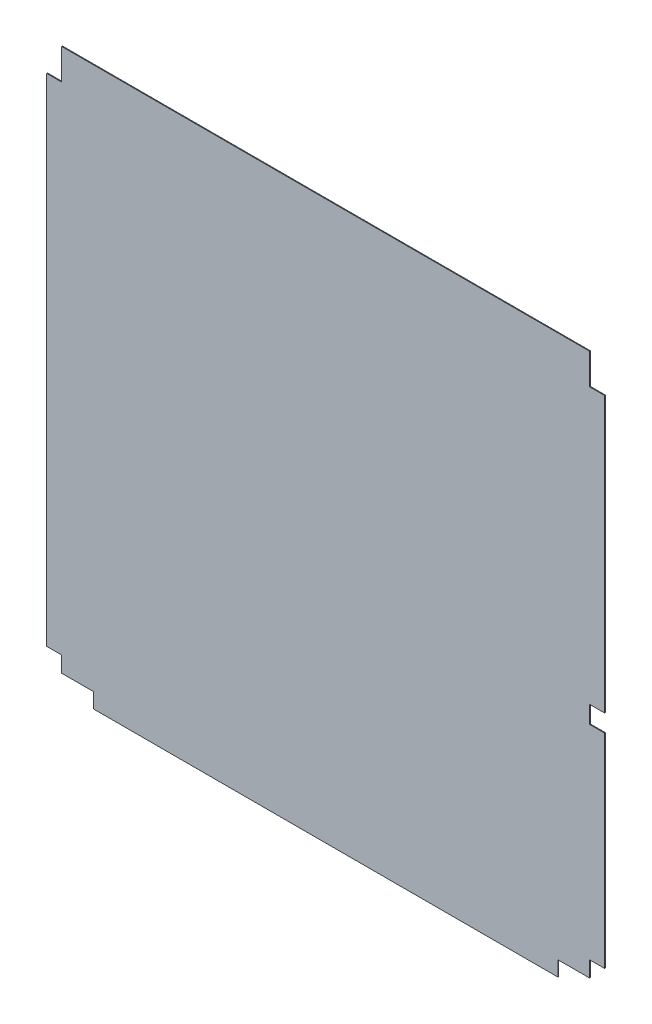
ISO-10303-21;
HEADER;
FILE_DESCRIPTION(('STEP AP214'),'2;1');
FILE_NAME('part.step','',(''),(''),'','','');
FILE_SCHEMA(('AUTOMOTIVE_DESIGN { 1 0 10303 214 1 1 1 1 }'));
ENDSEC;
DATA;
#1=APPLICATION_CONTEXT('core data for automotive mechanical design processes');
#2=APPLICATION_PROTOCOL_DEFINITION('international standard','automotive_design',2000,#1);
#3=PRODUCT_CONTEXT('',#1,'mechanical');
#4=PRODUCT('Part','Part','',(#3));
#5=PRODUCT_RELATED_PRODUCT_CATEGORY('part','',(#4));
#6=PRODUCT_DEFINITION_FORMATION('','',#4);
#7=PRODUCT_DEFINITION_CONTEXT('part definition',#1,'design');
#8=PRODUCT_DEFINITION('design','',#6,#7);
#9=PRODUCT_DEFINITION_SHAPE('','',#8);
#10=(LENGTH_UNIT() NAMED_UNIT(*) SI_UNIT(.MILLI.,.METRE.));
#11=(NAMED_UNIT(*) PLANE_ANGLE_UNIT() SI_UNIT($,.RADIAN.));
#12=(NAMED_UNIT(*) SI_UNIT($,.STERADIAN.) SOLID_ANGLE_UNIT());
#13=UNCERTAINTY_MEASURE_WITH_UNIT(LENGTH_MEASURE(1.E-05),#10,'distance_accuracy_value','');
#14=(GEOMETRIC_REPRESENTATION_CONTEXT(3) GLOBAL_UNCERTAINTY_ASSIGNED_CONTEXT((#13)) GLOBAL_UNIT_ASSIGNED_CONTEXT((#10,
#11,#12)) REPRESENTATION_CONTEXT('',''));
#15=CARTESIAN_POINT('',(0.,0.,0.));
#16=DIRECTION('',(0.,0.,1.));
#17=DIRECTION('',(1.,0.,0.));
#18=AXIS2_PLACEMENT_3D('',#15,#16,#17);
#19=CARTESIAN_POINT('',(0.,279.000000000001,1.));
#20=DIRECTION('',(0.,1.,0.));
#21=DIRECTION('',(0.,0.,1.));
#22=AXIS2_PLACEMENT_3D('',#19,#20,#21);
#23=PLANE('',#22);
#24=DIRECTION('',(1.,0.,0.));
#25=VECTOR('',#24,1.);
#26=CARTESIAN_POINT('',(0.,279.000000000001,0.));
#27=LINE('',#26,#25);
#28=CARTESIAN_POINT('',(-11.0000000000012,279.000000000001,0.));
#29=VERTEX_POINT('',#28);
#30=CARTESIAN_POINT('',(7.9989999999988,279.000000000001,0.));
#31=VERTEX_POINT('',#30);
#32=EDGE_CURVE('E204',#29,#31,#27,.T.);
#33=ORIENTED_EDGE('',*,*,#32,.F.);
#34=DIRECTION('',(0.,0.,-1.));
#35=VECTOR('',#34,1.);
#36=CARTESIAN_POINT('',(-11.0000000000012,279.000000000001,1.));
#37=LINE('',#36,#35);
#38=CARTESIAN_POINT('',(-11.0000000000012,279.000000000001,1.));
#39=VERTEX_POINT('',#38);
#40=EDGE_CURVE('E11',#39,#29,#37,.T.);
#41=ORIENTED_EDGE('',*,*,#40,.F.);
#42=DIRECTION('',(1.,0.,0.));
#43=VECTOR('',#42,1.);
#44=CARTESIAN_POINT('',(0.,279.000000000001,1.));
#45=LINE('',#44,#43);
#46=CARTESIAN_POINT('',(7.9989999999988,279.000000000001,1.));
#47=VERTEX_POINT('',#46);
#48=EDGE_CURVE('E258',#39,#47,#45,.T.);
#49=ORIENTED_EDGE('',*,*,#48,.T.);
#50=DIRECTION('',(0.,0.,-1.));
#51=VECTOR('',#50,1.);
#52=CARTESIAN_POINT('',(7.9989999999988,279.000000000001,1.));
#53=LINE('',#52,#51);
#54=EDGE_CURVE('E125',#47,#31,#53,.T.);
#55=ORIENTED_EDGE('',*,*,#54,.T.);
#56=EDGE_LOOP('',(#33,#41,#49,#55));
#57=FACE_BOUND('',#56,.T.);
#58=ADVANCED_FACE('F39',(#57),#23,.T.);
#59=CARTESIAN_POINT('',(-11.0000000000012,0.,1.));
#60=DIRECTION('',(1.,0.,0.));
#61=DIRECTION('',(0.,0.,-1.));
#62=AXIS2_PLACEMENT_3D('',#59,#60,#61);
#63=PLANE('',#62);
#64=DIRECTION('',(0.,-1.,0.));
#65=VECTOR('',#64,1.);
#66=CARTESIAN_POINT('',(-11.0000000000012,0.,0.));
#67=LINE('',#66,#65);
#68=CARTESIAN_POINT('',(-11.0000000000012,301.000000000001,0.));
#69=VERTEX_POINT('',#68);
#70=EDGE_CURVE('E207',#69,#29,#67,.T.);
#71=ORIENTED_EDGE('',*,*,#70,.F.);
#72=DIRECTION('',(0.,0.,-1.));
#73=VECTOR('',#72,1.);
#74=CARTESIAN_POINT('',(-11.0000000000012,301.000000000001,1.));
#75=LINE('',#74,#73);
#76=CARTESIAN_POINT('',(-11.0000000000012,301.000000000001,1.));
#77=VERTEX_POINT('',#76);
#78=EDGE_CURVE('E47',#77,#69,#75,.T.);
#79=ORIENTED_EDGE('',*,*,#78,.F.);
#80=DIRECTION('',(0.,-1.,0.));
#81=VECTOR('',#80,1.);
#82=CARTESIAN_POINT('',(-11.0000000000012,0.,1.));
#83=LINE('',#82,#81);
#84=EDGE_CURVE('E355',#77,#39,#83,.T.);
#85=ORIENTED_EDGE('',*,*,#84,.T.);
#86=ORIENTED_EDGE('',*,*,#40,.T.);
#87=EDGE_LOOP('',(#71,#79,#85,#86));
#88=FACE_BOUND('',#87,.T.);
#89=ADVANCED_FACE('F301',(#88),#63,.T.);
#90=CARTESIAN_POINT('',(0.,301.000000000001,1.));
#91=DIRECTION('',(0.,-1.,0.));
#92=DIRECTION('',(0.,0.,-1.));
#93=AXIS2_PLACEMENT_3D('',#90,#91,#92);
#94=PLANE('',#93);
#95=DIRECTION('',(-1.,0.,0.));
#96=VECTOR('',#95,1.);
#97=CARTESIAN_POINT('',(0.,301.000000000001,0.));
#98=LINE('',#97,#96);
#99=CARTESIAN_POINT('',(7.9989999999988,301.000000000001,0.));
#100=VERTEX_POINT('',#99);
#101=EDGE_CURVE('E210',#100,#69,#98,.T.);
#102=ORIENTED_EDGE('',*,*,#101,.F.);
#103=DIRECTION('',(0.,0.,-1.));
#104=VECTOR('',#103,1.);
#105=CARTESIAN_POINT('',(7.9989999999988,301.000000000001,1.));
#106=LINE('',#105,#104);
#107=CARTESIAN_POINT('',(7.9989999999988,301.000000000001,1.));
#108=VERTEX_POINT('',#107);
#109=EDGE_CURVE('E290',#108,#100,#106,.T.);
#110=ORIENTED_EDGE('',*,*,#109,.F.);
#111=DIRECTION('',(-1.,0.,0.));
#112=VECTOR('',#111,1.);
#113=CARTESIAN_POINT('',(0.,301.000000000001,1.));
#114=LINE('',#113,#112);
#115=EDGE_CURVE('E297',#108,#77,#114,.T.);
#116=ORIENTED_EDGE('',*,*,#115,.T.);
#117=ORIENTED_EDGE('',*,*,#78,.T.);
#118=EDGE_LOOP('',(#102,#110,#116,#117));
#119=FACE_BOUND('',#118,.T.);
#120=ADVANCED_FACE('F295',(#119),#94,.T.);
#121=CARTESIAN_POINT('',(7.99899999999776,0.,1.));
#122=DIRECTION('',(-1.,0.,0.));
#123=DIRECTION('',(0.,-1.,0.));
#124=AXIS2_PLACEMENT_3D('',#121,#122,#123);
#125=PLANE('',#124);
#126=DIRECTION('',(0.,1.,0.));
#127=VECTOR('',#126,1.);
#128=CARTESIAN_POINT('',(7.99899999999776,0.,0.));
#129=LINE('',#128,#127);
#130=CARTESIAN_POINT('',(7.999,649.,0.));
#131=VERTEX_POINT('',#130);
#132=EDGE_CURVE('E213',#100,#131,#129,.T.);
#133=ORIENTED_EDGE('',*,*,#132,.T.);
#134=DIRECTION('',(0.,0.,-1.));
#135=VECTOR('',#134,1.);
#136=CARTESIAN_POINT('',(7.999,649.,1.));
#137=LINE('',#136,#135);
#138=CARTESIAN_POINT('',(7.999,649.,1.));
#139=VERTEX_POINT('',#138);
#140=EDGE_CURVE('E287',#139,#131,#137,.T.);
#141=ORIENTED_EDGE('',*,*,#140,.F.);
#142=DIRECTION('',(0.,1.,0.));
#143=VECTOR('',#142,1.);
#144=CARTESIAN_POINT('',(7.99899999999776,0.,1.));
#145=LINE('',#144,#143);
#146=EDGE_CURVE('E318',#108,#139,#145,.T.);
#147=ORIENTED_EDGE('',*,*,#146,.F.);
#148=ORIENTED_EDGE('',*,*,#109,.T.);
#149=EDGE_LOOP('',(#133,#141,#147,#148));
#150=FACE_BOUND('',#149,.T.);
#151=ADVANCED_FACE('F309',(#150),#125,.F.);
#152=CARTESIAN_POINT('',(0.,649.,1.));
#153=DIRECTION('',(0.,-1.,0.));
#154=DIRECTION('',(0.,0.,-1.));
#155=AXIS2_PLACEMENT_3D('',#152,#153,#154);
#156=PLANE('',#155);
#157=DIRECTION('',(-1.,0.,0.));
#158=VECTOR('',#157,1.);
#159=CARTESIAN_POINT('',(0.,649.,0.));
#160=LINE('',#159,#158);
#161=CARTESIAN_POINT('',(-11.,649.,0.));
#162=VERTEX_POINT('',#161);
#163=EDGE_CURVE('E215',#131,#162,#160,.T.);
#164=ORIENTED_EDGE('',*,*,#163,.T.);
#165=DIRECTION('',(0.,0.,-1.));
#166=VECTOR('',#165,1.);
#167=CARTESIAN_POINT('',(-11.,649.,1.));
#168=LINE('',#167,#166);
#169=CARTESIAN_POINT('',(-11.,649.,1.));
#170=VERTEX_POINT('',#169);
#171=EDGE_CURVE('E284',#170,#162,#168,.T.);
#172=ORIENTED_EDGE('',*,*,#171,.F.);
#173=DIRECTION('',(-1.,0.,0.));
#174=VECTOR('',#173,1.);
#175=CARTESIAN_POINT('',(0.,649.,1.));
#176=LINE('',#175,#174);
#177=EDGE_CURVE('E315',#139,#170,#176,.T.);
#178=ORIENTED_EDGE('',*,*,#177,.F.);
#179=ORIENTED_EDGE('',*,*,#140,.T.);
#180=EDGE_LOOP('',(#164,#172,#178,#179));
#181=FACE_BOUND('',#180,.T.);
#182=ADVANCED_FACE('F313',(#181),#156,.F.);
#183=CARTESIAN_POINT('',(-11.,0.,1.));
#184=DIRECTION('',(-1.,0.,0.));
#185=DIRECTION('',(0.,0.,1.));
#186=AXIS2_PLACEMENT_3D('',#183,#184,#185);
#187=PLANE('',#186);
#188=DIRECTION('',(0.,1.,0.));
#189=VECTOR('',#188,1.);
#190=CARTESIAN_POINT('',(-11.,0.,0.));
#191=LINE('',#190,#189);
#192=CARTESIAN_POINT('',(-11.,687.999,0.));
#193=VERTEX_POINT('',#192);
#194=EDGE_CURVE('E217',#162,#193,#191,.T.);
#195=ORIENTED_EDGE('',*,*,#194,.T.);
#196=DIRECTION('',(0.,0.,-1.));
#197=VECTOR('',#196,1.);
#198=CARTESIAN_POINT('',(-11.,687.999,1.));
#199=LINE('',#198,#197);
#200=CARTESIAN_POINT('',(-11.,687.999,1.));
#201=VERTEX_POINT('',#200);
#202=EDGE_CURVE('E282',#201,#193,#199,.T.);
#203=ORIENTED_EDGE('',*,*,#202,.F.);
#204=DIRECTION('',(0.,1.,0.));
#205=VECTOR('',#204,1.);
#206=CARTESIAN_POINT('',(-11.,0.,1.));
#207=LINE('',#206,#205);
#208=EDGE_CURVE('E317',#170,#201,#207,.T.);
#209=ORIENTED_EDGE('',*,*,#208,.F.);
#210=ORIENTED_EDGE('',*,*,#171,.T.);
#211=EDGE_LOOP('',(#195,#203,#209,#210));
#212=FACE_BOUND('',#211,.T.);
#213=ADVANCED_FACE('F371',(#212),#187,.F.);
#214=CARTESIAN_POINT('',(1.37010284803689E-12,687.999,1.));
#215=DIRECTION('',(0.,1.,0.));
#216=DIRECTION('',(-1.,0.,0.));
#217=AXIS2_PLACEMENT_3D('',#214,#215,#216);
#218=PLANE('',#217);
#219=DIRECTION('',(1.,0.,0.));
#220=VECTOR('',#219,1.);
#221=CARTESIAN_POINT('',(1.37010284803689E-12,687.999,0.));
#222=LINE('',#221,#220);
#223=CARTESIAN_POINT('',(-678.999993815225,687.999000000001,0.));
#224=VERTEX_POINT('',#223);
#225=EDGE_CURVE('E220',#224,#193,#222,.T.);
#226=ORIENTED_EDGE('',*,*,#225,.F.);
#227=DIRECTION('',(0.,0.,-1.));
#228=VECTOR('',#227,1.);
#229=CARTESIAN_POINT('',(-678.999993815225,687.999000000001,1.));
#230=LINE('',#229,#228);
#231=CARTESIAN_POINT('',(-678.999993815225,687.999000000001,1.));
#232=VERTEX_POINT('',#231);
#233=EDGE_CURVE('E280',#232,#224,#230,.T.);
#234=ORIENTED_EDGE('',*,*,#233,.F.);
#235=DIRECTION('',(1.,0.,0.));
#236=VECTOR('',#235,1.);
#237=CARTESIAN_POINT('',(1.37010284803689E-12,687.999,1.));
#238=LINE('',#237,#236);
#239=EDGE_CURVE('E320',#232,#201,#238,.T.);
#240=ORIENTED_EDGE('',*,*,#239,.T.);
#241=ORIENTED_EDGE('',*,*,#202,.T.);
#242=EDGE_LOOP('',(#226,#234,#240,#241));
#243=FACE_BOUND('',#242,.T.);
#244=ADVANCED_FACE('F374',(#243),#218,.T.);
#245=CARTESIAN_POINT('',(-678.999993815225,0.,1.));
#246=DIRECTION('',(1.,0.,0.));
#247=DIRECTION('',(0.,0.,-1.));
#248=AXIS2_PLACEMENT_3D('',#245,#246,#247);
#249=PLANE('',#248);
#250=DIRECTION('',(0.,-1.,0.));
#251=VECTOR('',#250,1.);
#252=CARTESIAN_POINT('',(-678.999993815225,0.,0.));
#253=LINE('',#252,#251);
#254=CARTESIAN_POINT('',(-678.999993815225,649.000000000001,0.));
#255=VERTEX_POINT('',#254);
#256=EDGE_CURVE('E223',#224,#255,#253,.T.);
#257=ORIENTED_EDGE('',*,*,#256,.T.);
#258=DIRECTION('',(0.,0.,-1.));
#259=VECTOR('',#258,1.);
#260=CARTESIAN_POINT('',(-678.999993815225,649.000000000001,1.));
#261=LINE('',#260,#259);
#262=CARTESIAN_POINT('',(-678.999993815225,649.000000000001,1.));
#263=VERTEX_POINT('',#262);
#264=EDGE_CURVE('E278',#263,#255,#261,.T.);
#265=ORIENTED_EDGE('',*,*,#264,.F.);
#266=DIRECTION('',(0.,-1.,0.));
#267=VECTOR('',#266,1.);
#268=CARTESIAN_POINT('',(-678.999993815225,0.,1.));
#269=LINE('',#268,#267);
#270=EDGE_CURVE('E327',#232,#263,#269,.T.);
#271=ORIENTED_EDGE('',*,*,#270,.F.);
#272=ORIENTED_EDGE('',*,*,#233,.T.);
#273=EDGE_LOOP('',(#257,#265,#271,#272));
#274=FACE_BOUND('',#273,.T.);
#275=ADVANCED_FACE('F378',(#274),#249,.F.);
#276=CARTESIAN_POINT('',(3.79248649099919E-12,648.999999999997,1.));
#277=DIRECTION('',(0.,1.,0.));
#278=DIRECTION('',(-1.,0.,0.));
#279=AXIS2_PLACEMENT_3D('',#276,#277,#278);
#280=PLANE('',#279);
#281=DIRECTION('',(1.,0.,0.));
#282=VECTOR('',#281,1.);
#283=CARTESIAN_POINT('',(3.79248649099919E-12,648.999999999997,0.));
#284=LINE('',#283,#282);
#285=CARTESIAN_POINT('',(-697.999000000001,649.000000000001,0.));
#286=VERTEX_POINT('',#285);
#287=EDGE_CURVE('E226',#286,#255,#284,.T.);
#288=ORIENTED_EDGE('',*,*,#287,.F.);
#289=DIRECTION('',(0.,0.,-1.));
#290=VECTOR('',#289,1.);
#291=CARTESIAN_POINT('',(-697.999000000001,649.000000000001,1.));
#292=LINE('',#291,#290);
#293=CARTESIAN_POINT('',(-697.999000000001,649.000000000001,1.));
#294=VERTEX_POINT('',#293);
#295=EDGE_CURVE('E276',#294,#286,#292,.T.);
#296=ORIENTED_EDGE('',*,*,#295,.F.);
#297=DIRECTION('',(1.,0.,0.));
#298=VECTOR('',#297,1.);
#299=CARTESIAN_POINT('',(3.79248649099919E-12,648.999999999997,1.));
#300=LINE('',#299,#298);
#301=EDGE_CURVE('E329',#294,#263,#300,.T.);
#302=ORIENTED_EDGE('',*,*,#301,.T.);
#303=ORIENTED_EDGE('',*,*,#264,.T.);
#304=EDGE_LOOP('',(#288,#296,#302,#303));
#305=FACE_BOUND('',#304,.T.);
#306=ADVANCED_FACE('F382',(#305),#280,.T.);
#307=CARTESIAN_POINT('',(-697.999,-1.35736945392017E-12,1.));
#308=DIRECTION('',(-1.,0.,0.));
#309=DIRECTION('',(0.,-1.,0.));
#310=AXIS2_PLACEMENT_3D('',#307,#308,#309);
#311=PLANE('',#310);
#312=DIRECTION('',(0.,1.,0.));
#313=VECTOR('',#312,1.);
#314=CARTESIAN_POINT('',(-697.999,-1.35736945392017E-12,0.));
#315=LINE('',#314,#313);
#316=CARTESIAN_POINT('',(-697.999,21.,0.));
#317=VERTEX_POINT('',#316);
#318=EDGE_CURVE('E229',#317,#286,#315,.T.);
#319=ORIENTED_EDGE('',*,*,#318,.F.);
#320=DIRECTION('',(0.,0.,-1.));
#321=VECTOR('',#320,1.);
#322=CARTESIAN_POINT('',(-697.999,21.,1.));
#323=LINE('',#322,#321);
#324=CARTESIAN_POINT('',(-697.999,21.,1.));
#325=VERTEX_POINT('',#324);
#326=EDGE_CURVE('E274',#325,#317,#323,.T.);
#327=ORIENTED_EDGE('',*,*,#326,.F.);
#328=DIRECTION('',(0.,1.,0.));
#329=VECTOR('',#328,1.);
#330=CARTESIAN_POINT('',(-697.999,-1.35736945392017E-12,1.));
#331=LINE('',#330,#329);
#332=EDGE_CURVE('E332',#325,#294,#331,.T.);
#333=ORIENTED_EDGE('',*,*,#332,.T.);
#334=ORIENTED_EDGE('',*,*,#295,.T.);
#335=EDGE_LOOP('',(#319,#327,#333,#334));
#336=FACE_BOUND('',#335,.T.);
#337=ADVANCED_FACE('F386',(#336),#311,.T.);
#338=CARTESIAN_POINT('',(0.,21.,1.));
#339=DIRECTION('',(0.,1.,0.));
#340=DIRECTION('',(0.,0.,1.));
#341=AXIS2_PLACEMENT_3D('',#338,#339,#340);
#342=PLANE('',#341);
#343=DIRECTION('',(1.,0.,0.));
#344=VECTOR('',#343,1.);
#345=CARTESIAN_POINT('',(0.,21.,0.));
#346=LINE('',#345,#344);
#347=CARTESIAN_POINT('',(-679.000000000001,21.,0.));
#348=VERTEX_POINT('',#347);
#349=EDGE_CURVE('E232',#317,#348,#346,.T.);
#350=ORIENTED_EDGE('',*,*,#349,.T.);
#351=DIRECTION('',(0.,0.,-1.));
#352=VECTOR('',#351,1.);
#353=CARTESIAN_POINT('',(-679.000000000001,21.,1.));
#354=LINE('',#353,#352);
#355=CARTESIAN_POINT('',(-679.000000000001,21.,1.));
#356=VERTEX_POINT('',#355);
#357=EDGE_CURVE('E272',#356,#348,#354,.T.);
#358=ORIENTED_EDGE('',*,*,#357,.F.);
#359=DIRECTION('',(1.,0.,0.));
#360=VECTOR('',#359,1.);
#361=CARTESIAN_POINT('',(0.,21.,1.));
#362=LINE('',#361,#360);
#363=EDGE_CURVE('E335',#325,#356,#362,.T.);
#364=ORIENTED_EDGE('',*,*,#363,.F.);
#365=ORIENTED_EDGE('',*,*,#326,.T.);
#366=EDGE_LOOP('',(#350,#358,#364,#365));
#367=FACE_BOUND('',#366,.T.);
#368=ADVANCED_FACE('F390',(#367),#342,.F.);
#369=CARTESIAN_POINT('',(-679.000000000001,0.,1.));
#370=DIRECTION('',(-1.,0.,0.));
#371=DIRECTION('',(0.,0.,1.));
#372=AXIS2_PLACEMENT_3D('',#369,#370,#371);
#373=PLANE('',#372);
#374=DIRECTION('',(0.,1.,0.));
#375=VECTOR('',#374,1.);
#376=CARTESIAN_POINT('',(-679.000000000001,0.,0.));
#377=LINE('',#376,#375);
#378=CARTESIAN_POINT('',(-679.000000000001,1.00000000000141,0.));
#379=VERTEX_POINT('',#378);
#380=EDGE_CURVE('E235',#379,#348,#377,.T.);
#381=ORIENTED_EDGE('',*,*,#380,.F.);
#382=DIRECTION('',(0.,0.,-1.));
#383=VECTOR('',#382,1.);
#384=CARTESIAN_POINT('',(-679.000000000001,1.00000000000141,1.));
#385=LINE('',#384,#383);
#386=CARTESIAN_POINT('',(-679.000000000001,1.00000000000141,1.));
#387=VERTEX_POINT('',#386);
#388=EDGE_CURVE('E270',#387,#379,#385,.T.);
#389=ORIENTED_EDGE('',*,*,#388,.F.);
#390=DIRECTION('',(0.,1.,0.));
#391=VECTOR('',#390,1.);
#392=CARTESIAN_POINT('',(-679.000000000001,0.,1.));
#393=LINE('',#392,#391);
#394=EDGE_CURVE('E337',#387,#356,#393,.T.);
#395=ORIENTED_EDGE('',*,*,#394,.T.);
#396=ORIENTED_EDGE('',*,*,#357,.T.);
#397=EDGE_LOOP('',(#381,#389,#395,#396));
#398=FACE_BOUND('',#397,.T.);
#399=ADVANCED_FACE('F394',(#398),#373,.T.);
#400=CARTESIAN_POINT('',(0.,0.999999999977404,1.));
#401=DIRECTION('',(0.,-1.,0.));
#402=DIRECTION('',(1.,0.,0.));
#403=AXIS2_PLACEMENT_3D('',#400,#401,#402);
#404=PLANE('',#403);
#405=DIRECTION('',(-1.,0.,0.));
#406=VECTOR('',#405,1.);
#407=CARTESIAN_POINT('',(0.,0.999999999977404,0.));
#408=LINE('',#407,#406);
#409=CARTESIAN_POINT('',(-638.999993815225,1.,0.));
#410=VERTEX_POINT('',#409);
#411=EDGE_CURVE('E238',#410,#379,#408,.T.);
#412=ORIENTED_EDGE('',*,*,#411,.F.);
#413=DIRECTION('',(0.,0.,-1.));
#414=VECTOR('',#413,1.);
#415=CARTESIAN_POINT('',(-638.999993815225,1.,1.));
#416=LINE('',#415,#414);
#417=CARTESIAN_POINT('',(-638.999993815225,1.,1.));
#418=VERTEX_POINT('',#417);
#419=EDGE_CURVE('E268',#418,#410,#416,.T.);
#420=ORIENTED_EDGE('',*,*,#419,.F.);
#421=DIRECTION('',(-1.,0.,0.));
#422=VECTOR('',#421,1.);
#423=CARTESIAN_POINT('',(0.,0.999999999977404,1.));
#424=LINE('',#423,#422);
#425=EDGE_CURVE('E340',#418,#387,#424,.T.);
#426=ORIENTED_EDGE('',*,*,#425,.T.);
#427=ORIENTED_EDGE('',*,*,#388,.T.);
#428=EDGE_LOOP('',(#412,#420,#426,#427));
#429=FACE_BOUND('',#428,.T.);
#430=ADVANCED_FACE('F398',(#429),#404,.T.);
#431=CARTESIAN_POINT('',(-638.999993815225,0.,1.));
#432=DIRECTION('',(-1.,0.,0.));
#433=DIRECTION('',(0.,0.,1.));
#434=AXIS2_PLACEMENT_3D('',#431,#432,#433);
#435=PLANE('',#434);
#436=DIRECTION('',(0.,1.,0.));
#437=VECTOR('',#436,1.);
#438=CARTESIAN_POINT('',(-638.999993815225,0.,0.));
#439=LINE('',#438,#437);
#440=CARTESIAN_POINT('',(-638.999993815225,-17.9989999999986,0.));
#441=VERTEX_POINT('',#440);
#442=EDGE_CURVE('E241',#441,#410,#439,.T.);
#443=ORIENTED_EDGE('',*,*,#442,.F.);
#444=DIRECTION('',(0.,0.,-1.));
#445=VECTOR('',#444,1.);
#446=CARTESIAN_POINT('',(-638.999993815225,-17.9989999999986,1.));
#447=LINE('',#446,#445);
#448=CARTESIAN_POINT('',(-638.999993815225,-17.9989999999986,1.));
#449=VERTEX_POINT('',#448);
#450=EDGE_CURVE('E266',#449,#441,#447,.T.);
#451=ORIENTED_EDGE('',*,*,#450,.F.);
#452=DIRECTION('',(0.,1.,0.));
#453=VECTOR('',#452,1.);
#454=CARTESIAN_POINT('',(-638.999993815225,0.,1.));
#455=LINE('',#454,#453);
#456=EDGE_CURVE('E343',#449,#418,#455,.T.);
#457=ORIENTED_EDGE('',*,*,#456,.T.);
#458=ORIENTED_EDGE('',*,*,#419,.T.);
#459=EDGE_LOOP('',(#443,#451,#457,#458));
#460=FACE_BOUND('',#459,.T.);
#461=ADVANCED_FACE('F402',(#460),#435,.T.);
#462=CARTESIAN_POINT('',(0.,-17.9989999999984,1.));
#463=DIRECTION('',(0.,1.,0.));
#464=DIRECTION('',(-1.,0.,0.));
#465=AXIS2_PLACEMENT_3D('',#462,#463,#464);
#466=PLANE('',#465);
#467=DIRECTION('',(1.,0.,0.));
#468=VECTOR('',#467,1.);
#469=CARTESIAN_POINT('',(0.,-17.9989999999984,0.));
#470=LINE('',#469,#468);
#471=CARTESIAN_POINT('',(-50.9999968921069,-17.9989999999984,0.));
#472=VERTEX_POINT('',#471);
#473=EDGE_CURVE('E244',#441,#472,#470,.T.);
#474=ORIENTED_EDGE('',*,*,#473,.T.);
#475=DIRECTION('',(0.,0.,-1.));
#476=VECTOR('',#475,1.);
#477=CARTESIAN_POINT('',(-50.9999968921069,-17.9989999999984,1.));
#478=LINE('',#477,#476);
#479=CARTESIAN_POINT('',(-50.9999968921069,-17.9989999999984,1.));
#480=VERTEX_POINT('',#479);
#481=EDGE_CURVE('E264',#480,#472,#478,.T.);
#482=ORIENTED_EDGE('',*,*,#481,.F.);
#483=DIRECTION('',(1.,0.,0.));
#484=VECTOR('',#483,1.);
#485=CARTESIAN_POINT('',(0.,-17.9989999999984,1.));
#486=LINE('',#485,#484);
#487=EDGE_CURVE('E346',#449,#480,#486,.T.);
#488=ORIENTED_EDGE('',*,*,#487,.F.);
#489=ORIENTED_EDGE('',*,*,#450,.T.);
#490=EDGE_LOOP('',(#474,#482,#488,#489));
#491=FACE_BOUND('',#490,.T.);
#492=ADVANCED_FACE('F406',(#491),#466,.F.);
#493=CARTESIAN_POINT('',(-50.9999968921069,0.,1.));
#494=DIRECTION('',(1.,0.,0.));
#495=DIRECTION('',(0.,0.,-1.));
#496=AXIS2_PLACEMENT_3D('',#493,#494,#495);
#497=PLANE('',#496);
#498=DIRECTION('',(0.,-1.,0.));
#499=VECTOR('',#498,1.);
#500=CARTESIAN_POINT('',(-50.9999968921069,0.,0.));
#501=LINE('',#500,#499);
#502=CARTESIAN_POINT('',(-50.9999968921069,1.,0.));
#503=VERTEX_POINT('',#502);
#504=EDGE_CURVE('E247',#503,#472,#501,.T.);
#505=ORIENTED_EDGE('',*,*,#504,.F.);
#506=DIRECTION('',(0.,0.,-1.));
#507=VECTOR('',#506,1.);
#508=CARTESIAN_POINT('',(-50.9999968921069,1.,1.));
#509=LINE('',#508,#507);
#510=CARTESIAN_POINT('',(-50.9999968921069,1.,1.));
#511=VERTEX_POINT('',#510);
#512=EDGE_CURVE('E262',#511,#503,#509,.T.);
#513=ORIENTED_EDGE('',*,*,#512,.F.);
#514=DIRECTION('',(0.,-1.,0.));
#515=VECTOR('',#514,1.);
#516=CARTESIAN_POINT('',(-50.9999968921069,0.,1.));
#517=LINE('',#516,#515);
#518=EDGE_CURVE('E348',#511,#480,#517,.T.);
#519=ORIENTED_EDGE('',*,*,#518,.T.);
#520=ORIENTED_EDGE('',*,*,#481,.T.);
#521=EDGE_LOOP('',(#505,#513,#519,#520));
#522=FACE_BOUND('',#521,.T.);
#523=ADVANCED_FACE('F410',(#522),#497,.T.);
#524=CARTESIAN_POINT('',(0.,1.,1.));
#525=DIRECTION('',(0.,-1.,0.));
#526=DIRECTION('',(0.,0.,-1.));
#527=AXIS2_PLACEMENT_3D('',#524,#525,#526);
#528=PLANE('',#527);
#529=DIRECTION('',(-1.,0.,0.));
#530=VECTOR('',#529,1.);
#531=CARTESIAN_POINT('',(0.,1.,0.));
#532=LINE('',#531,#530);
#533=CARTESIAN_POINT('',(-11.0000000000001,1.,0.));
#534=VERTEX_POINT('',#533);
#535=EDGE_CURVE('E250',#534,#503,#532,.T.);
#536=ORIENTED_EDGE('',*,*,#535,.F.);
#537=DIRECTION('',(0.,0.,-1.));
#538=VECTOR('',#537,1.);
#539=CARTESIAN_POINT('',(-11.0000000000001,1.,1.));
#540=LINE('',#539,#538);
#541=CARTESIAN_POINT('',(-11.0000000000001,1.,1.));
#542=VERTEX_POINT('',#541);
#543=EDGE_CURVE('E197',#542,#534,#540,.T.);
#544=ORIENTED_EDGE('',*,*,#543,.F.);
#545=DIRECTION('',(-1.,0.,0.));
#546=VECTOR('',#545,1.);
#547=CARTESIAN_POINT('',(0.,1.,1.));
#548=LINE('',#547,#546);
#549=EDGE_CURVE('E186',#542,#511,#548,.T.);
#550=ORIENTED_EDGE('',*,*,#549,.T.);
#551=ORIENTED_EDGE('',*,*,#512,.T.);
#552=EDGE_LOOP('',(#536,#544,#550,#551));
#553=FACE_BOUND('',#552,.T.);
#554=ADVANCED_FACE('F352',(#553),#528,.T.);
#555=CARTESIAN_POINT('',(-11.0000000000001,0.,1.));
#556=DIRECTION('',(-1.,0.,0.));
#557=DIRECTION('',(0.,0.,1.));
#558=AXIS2_PLACEMENT_3D('',#555,#556,#557);
#559=PLANE('',#558);
#560=DIRECTION('',(0.,1.,0.));
#561=VECTOR('',#560,1.);
#562=CARTESIAN_POINT('',(-11.0000000000001,0.,0.));
#563=LINE('',#562,#561);
#564=CARTESIAN_POINT('',(-11.0000000000001,21.,0.));
#565=VERTEX_POINT('',#564);
#566=EDGE_CURVE('E193',#534,#565,#563,.T.);
#567=ORIENTED_EDGE('',*,*,#566,.T.);
#568=DIRECTION('',(0.,0.,-1.));
#569=VECTOR('',#568,1.);
#570=CARTESIAN_POINT('',(-11.0000000000001,21.,1.));
#571=LINE('',#570,#569);
#572=CARTESIAN_POINT('',(-11.0000000000001,21.,1.));
#573=VERTEX_POINT('',#572);
#574=EDGE_CURVE('E190',#573,#565,#571,.T.);
#575=ORIENTED_EDGE('',*,*,#574,.F.);
#576=DIRECTION('',(0.,1.,0.));
#577=VECTOR('',#576,1.);
#578=CARTESIAN_POINT('',(-11.0000000000001,0.,1.));
#579=LINE('',#578,#577);
#580=EDGE_CURVE('E179',#542,#573,#579,.T.);
#581=ORIENTED_EDGE('',*,*,#580,.F.);
#582=ORIENTED_EDGE('',*,*,#543,.T.);
#583=EDGE_LOOP('',(#567,#575,#581,#582));
#584=FACE_BOUND('',#583,.T.);
#585=ADVANCED_FACE('F191',(#584),#559,.F.);
#586=CARTESIAN_POINT('',(0.,21.,1.));
#587=DIRECTION('',(0.,-1.,0.));
#588=DIRECTION('',(0.,0.,-1.));
#589=AXIS2_PLACEMENT_3D('',#586,#587,#588);
#590=PLANE('',#589);
#591=DIRECTION('',(-1.,0.,0.));
#592=VECTOR('',#591,1.);
#593=CARTESIAN_POINT('',(0.,21.,0.));
#594=LINE('',#593,#592);
#595=CARTESIAN_POINT('',(7.999,21.,0.));
#596=VERTEX_POINT('',#595);
#597=EDGE_CURVE('E254',#596,#565,#594,.T.);
#598=ORIENTED_EDGE('',*,*,#597,.F.);
#599=DIRECTION('',(0.,0.,-1.));
#600=VECTOR('',#599,1.);
#601=CARTESIAN_POINT('',(7.999,21.,1.));
#602=LINE('',#601,#600);
#603=CARTESIAN_POINT('',(7.999,21.,1.));
#604=VERTEX_POINT('',#603);
#605=EDGE_CURVE('E118',#604,#596,#602,.T.);
#606=ORIENTED_EDGE('',*,*,#605,.F.);
#607=DIRECTION('',(-1.,0.,0.));
#608=VECTOR('',#607,1.);
#609=CARTESIAN_POINT('',(0.,21.,1.));
#610=LINE('',#609,#608);
#611=EDGE_CURVE('E183',#604,#573,#610,.T.);
#612=ORIENTED_EDGE('',*,*,#611,.T.);
#613=ORIENTED_EDGE('',*,*,#574,.T.);
#614=EDGE_LOOP('',(#598,#606,#612,#613));
#615=FACE_BOUND('',#614,.T.);
#616=ADVANCED_FACE('F199',(#615),#590,.T.);
#617=CARTESIAN_POINT('',(7.9990000000001,0.,1.));
#618=DIRECTION('',(-1.,0.,0.));
#619=DIRECTION('',(0.,-1.,0.));
#620=AXIS2_PLACEMENT_3D('',#617,#618,#619);
#621=PLANE('',#620);
#622=DIRECTION('',(0.,1.,0.));
#623=VECTOR('',#622,1.);
#624=CARTESIAN_POINT('',(7.9990000000001,0.,0.));
#625=LINE('',#624,#623);
#626=EDGE_CURVE('E256',#596,#31,#625,.T.);
#627=ORIENTED_EDGE('',*,*,#626,.T.);
#628=ORIENTED_EDGE('',*,*,#54,.F.);
#629=DIRECTION('',(0.,1.,0.));
#630=VECTOR('',#629,1.);
#631=CARTESIAN_POINT('',(7.9990000000001,0.,1.));
#632=LINE('',#631,#630);
#633=EDGE_CURVE('E55',#604,#47,#632,.T.);
#634=ORIENTED_EDGE('',*,*,#633,.F.);
#635=ORIENTED_EDGE('',*,*,#605,.T.);
#636=EDGE_LOOP('',(#627,#628,#634,#635));
#637=FACE_BOUND('',#636,.T.);
#638=ADVANCED_FACE('F354',(#637),#621,.F.);
#639=CARTESIAN_POINT('',(0.,0.,1.));
#640=DIRECTION('',(0.,0.,1.));
#641=DIRECTION('',(1.,0.,0.));
#642=AXIS2_PLACEMENT_3D('',#639,#640,#641);
#643=PLANE('',#642);
#644=ORIENTED_EDGE('',*,*,#48,.F.);
#645=ORIENTED_EDGE('',*,*,#84,.F.);
#646=ORIENTED_EDGE('',*,*,#115,.F.);
#647=ORIENTED_EDGE('',*,*,#146,.T.);
#648=ORIENTED_EDGE('',*,*,#177,.T.);
#649=ORIENTED_EDGE('',*,*,#208,.T.);
#650=ORIENTED_EDGE('',*,*,#239,.F.);
#651=ORIENTED_EDGE('',*,*,#270,.T.);
#652=ORIENTED_EDGE('',*,*,#301,.F.);
#653=ORIENTED_EDGE('',*,*,#332,.F.);
#654=ORIENTED_EDGE('',*,*,#363,.T.);
#655=ORIENTED_EDGE('',*,*,#394,.F.);
#656=ORIENTED_EDGE('',*,*,#425,.F.);
#657=ORIENTED_EDGE('',*,*,#456,.F.);
#658=ORIENTED_EDGE('',*,*,#487,.T.);
#659=ORIENTED_EDGE('',*,*,#518,.F.);
#660=ORIENTED_EDGE('',*,*,#549,.F.);
#661=ORIENTED_EDGE('',*,*,#580,.T.);
#662=ORIENTED_EDGE('',*,*,#611,.F.);
#663=ORIENTED_EDGE('',*,*,#633,.T.);
#664=EDGE_LOOP('',(#644,#645,#646,#647,#648,#649,#650,#651,#652,#653,#654,#655,#656,#657,#658,
#659,#660,#661,#662,#663));
#665=FACE_BOUND('',#664,.T.);
#666=ADVANCED_FACE('F181',(#665),#643,.T.);
#667=CARTESIAN_POINT('',(0.,0.,0.));
#668=DIRECTION('',(0.,0.,1.));
#669=DIRECTION('',(1.,0.,0.));
#670=AXIS2_PLACEMENT_3D('',#667,#668,#669);
#671=PLANE('',#670);
#672=ORIENTED_EDGE('',*,*,#32,.T.);
#673=ORIENTED_EDGE('',*,*,#626,.F.);
#674=ORIENTED_EDGE('',*,*,#597,.T.);
#675=ORIENTED_EDGE('',*,*,#566,.F.);
#676=ORIENTED_EDGE('',*,*,#535,.T.);
#677=ORIENTED_EDGE('',*,*,#504,.T.);
#678=ORIENTED_EDGE('',*,*,#473,.F.);
#679=ORIENTED_EDGE('',*,*,#442,.T.);
#680=ORIENTED_EDGE('',*,*,#411,.T.);
#681=ORIENTED_EDGE('',*,*,#380,.T.);
#682=ORIENTED_EDGE('',*,*,#349,.F.);
#683=ORIENTED_EDGE('',*,*,#318,.T.);
#684=ORIENTED_EDGE('',*,*,#287,.T.);
#685=ORIENTED_EDGE('',*,*,#256,.F.);
#686=ORIENTED_EDGE('',*,*,#225,.T.);
#687=ORIENTED_EDGE('',*,*,#194,.F.);
#688=ORIENTED_EDGE('',*,*,#163,.F.);
#689=ORIENTED_EDGE('',*,*,#132,.F.);
#690=ORIENTED_EDGE('',*,*,#101,.T.);
#691=ORIENTED_EDGE('',*,*,#70,.T.);
#692=EDGE_LOOP('',(#672,#673,#674,#675,#676,#677,#678,#679,#680,#681,#682,#683,#684,#685,#686,
#687,#688,#689,#690,#691));
#693=FACE_BOUND('',#692,.T.);
#694=ADVANCED_FACE('F304',(#693),#671,.F.);
#695=CLOSED_SHELL('',(#58,#89,#120,#151,#182,#213,#244,#275,#306,#337,#368,#399,#430,#461,#492,
#523,#554,#585,#616,#638,#666,#694));
#696=MANIFOLD_SOLID_BREP('B2',#695);
#697=ADVANCED_BREP_SHAPE_REPRESENTATION('',(#18,#696),#14);
#698=SHAPE_DEFINITION_REPRESENTATION(#9,#697);
ENDSEC;
END-ISO-10303-21;
